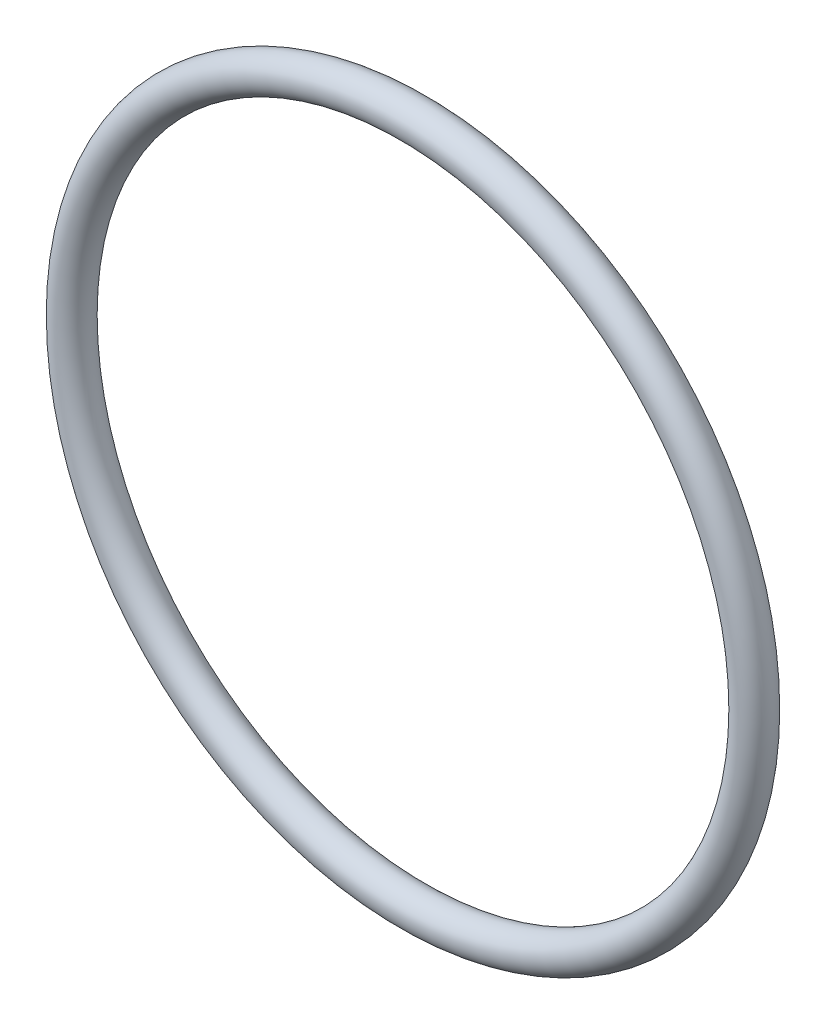
ISO-10303-21;
HEADER;
FILE_DESCRIPTION(('STEP AP214'),'2;1');
FILE_NAME('part.step','',(''),(''),'','','');
FILE_SCHEMA(('AUTOMOTIVE_DESIGN { 1 0 10303 214 1 1 1 1 }'));
ENDSEC;
DATA;
#1=APPLICATION_CONTEXT('core data for automotive mechanical design processes');
#2=APPLICATION_PROTOCOL_DEFINITION('international standard','automotive_design',2000,#1);
#3=PRODUCT_CONTEXT('',#1,'mechanical');
#4=PRODUCT('Part','Part','',(#3));
#5=PRODUCT_RELATED_PRODUCT_CATEGORY('part','',(#4));
#6=PRODUCT_DEFINITION_FORMATION('','',#4);
#7=PRODUCT_DEFINITION_CONTEXT('part definition',#1,'design');
#8=PRODUCT_DEFINITION('design','',#6,#7);
#9=PRODUCT_DEFINITION_SHAPE('','',#8);
#10=(LENGTH_UNIT() NAMED_UNIT(*) SI_UNIT(.MILLI.,.METRE.));
#11=(NAMED_UNIT(*) PLANE_ANGLE_UNIT() SI_UNIT($,.RADIAN.));
#12=(NAMED_UNIT(*) SI_UNIT($,.STERADIAN.) SOLID_ANGLE_UNIT());
#13=UNCERTAINTY_MEASURE_WITH_UNIT(LENGTH_MEASURE(1.E-05),#10,'distance_accuracy_value','');
#14=(GEOMETRIC_REPRESENTATION_CONTEXT(3) GLOBAL_UNCERTAINTY_ASSIGNED_CONTEXT((#13)) GLOBAL_UNIT_ASSIGNED_CONTEXT((#10,
#11,#12)) REPRESENTATION_CONTEXT('',''));
#15=CARTESIAN_POINT('',(0.,0.,0.));
#16=DIRECTION('',(0.,0.,1.));
#17=DIRECTION('',(1.,0.,0.));
#18=AXIS2_PLACEMENT_3D('',#15,#16,#17);
#19=CARTESIAN_POINT('',(24.81,0.,0.));
#20=DIRECTION('',(0.,0.,1.));
#21=DIRECTION('',(1.,0.,0.));
#22=AXIS2_PLACEMENT_3D('',#19,#20,#21);
#23=TOROIDAL_SURFACE('',#22,24.81,1.3081);
#24=CARTESIAN_POINT('',(50.9281,0.,0.));
#25=VERTEX_POINT('',#24);
#26=VERTEX_LOOP('',#25);
#27=FACE_BOUND('',#26,.T.);
#28=ADVANCED_FACE('F32',(#27),#23,.T.);
#29=CLOSED_SHELL('',(#28));
#30=MANIFOLD_SOLID_BREP('B2',#29);
#31=ADVANCED_BREP_SHAPE_REPRESENTATION('',(#18,#30),#14);
#32=SHAPE_DEFINITION_REPRESENTATION(#9,#31);
ENDSEC;
END-ISO-10303-21;
